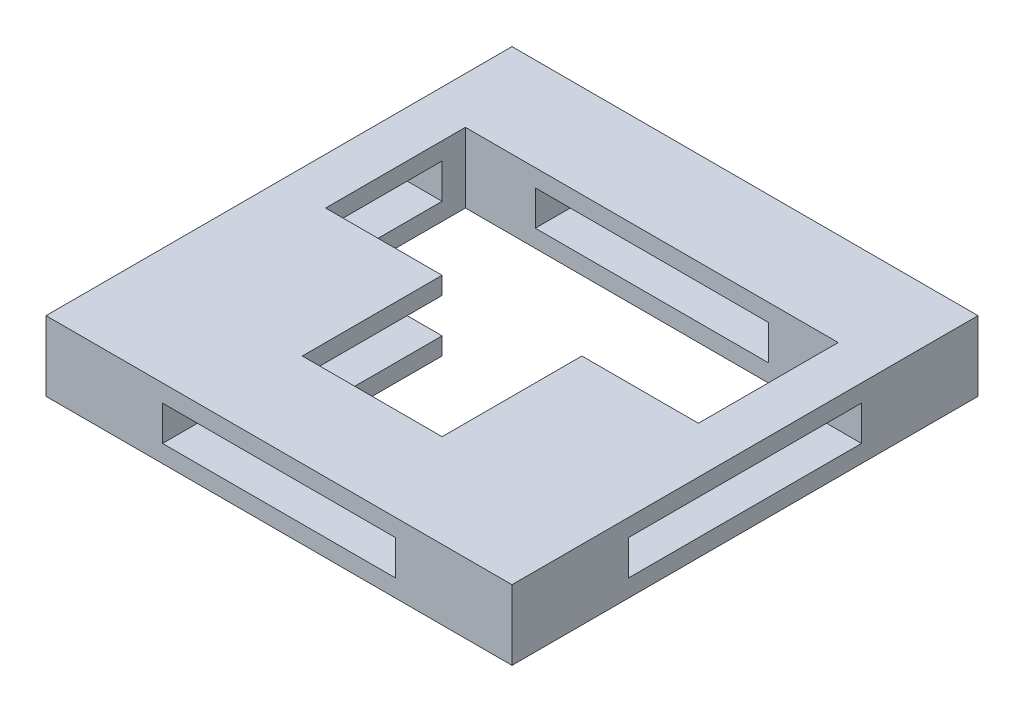
ISO-10303-21;
HEADER;
FILE_DESCRIPTION(('STEP AP214'),'2;1');
FILE_NAME('part.step','',(''),(''),'','','');
FILE_SCHEMA(('AUTOMOTIVE_DESIGN { 1 0 10303 214 1 1 1 1 }'));
ENDSEC;
DATA;
#1=APPLICATION_CONTEXT('core data for automotive mechanical design processes');
#2=APPLICATION_PROTOCOL_DEFINITION('international standard','automotive_design',2000,#1);
#3=PRODUCT_CONTEXT('',#1,'mechanical');
#4=PRODUCT('Part','Part','',(#3));
#5=PRODUCT_RELATED_PRODUCT_CATEGORY('part','',(#4));
#6=PRODUCT_DEFINITION_FORMATION('','',#4);
#7=PRODUCT_DEFINITION_CONTEXT('part definition',#1,'design');
#8=PRODUCT_DEFINITION('design','',#6,#7);
#9=PRODUCT_DEFINITION_SHAPE('','',#8);
#10=(LENGTH_UNIT() NAMED_UNIT(*) SI_UNIT(.MILLI.,.METRE.));
#11=(NAMED_UNIT(*) PLANE_ANGLE_UNIT() SI_UNIT($,.RADIAN.));
#12=(NAMED_UNIT(*) SI_UNIT($,.STERADIAN.) SOLID_ANGLE_UNIT());
#13=UNCERTAINTY_MEASURE_WITH_UNIT(LENGTH_MEASURE(1.E-05),#10,'distance_accuracy_value','');
#14=(GEOMETRIC_REPRESENTATION_CONTEXT(3) GLOBAL_UNCERTAINTY_ASSIGNED_CONTEXT((#13)) GLOBAL_UNIT_ASSIGNED_CONTEXT((#10,
#11,#12)) REPRESENTATION_CONTEXT('',''));
#15=CARTESIAN_POINT('',(0.,0.,0.));
#16=DIRECTION('',(0.,0.,1.));
#17=DIRECTION('',(1.,0.,0.));
#18=AXIS2_PLACEMENT_3D('',#15,#16,#17);
#19=CARTESIAN_POINT('',(0.,3.,0.));
#20=DIRECTION('',(0.,0.,-1.));
#21=DIRECTION('',(-1.,0.,0.));
#22=AXIS2_PLACEMENT_3D('',#19,#20,#21);
#23=PLANE('',#22);
#24=DIRECTION('',(1.,0.,0.));
#25=VECTOR('',#24,1.);
#26=CARTESIAN_POINT('',(0.,2.25,0.));
#27=LINE('',#26,#25);
#28=CARTESIAN_POINT('',(-8.,2.25,0.));
#29=VERTEX_POINT('',#28);
#30=CARTESIAN_POINT('',(-3.,2.25,0.));
#31=VERTEX_POINT('',#30);
#32=EDGE_CURVE('E421',#29,#31,#27,.T.);
#33=ORIENTED_EDGE('',*,*,#32,.F.);
#34=DIRECTION('',(0.,-1.,0.));
#35=VECTOR('',#34,1.);
#36=CARTESIAN_POINT('',(-8.,3.,0.));
#37=LINE('',#36,#35);
#38=CARTESIAN_POINT('',(-8.,3.,0.));
#39=VERTEX_POINT('',#38);
#40=EDGE_CURVE('E557',#39,#29,#37,.T.);
#41=ORIENTED_EDGE('',*,*,#40,.F.);
#42=DIRECTION('',(1.,0.,0.));
#43=VECTOR('',#42,1.);
#44=CARTESIAN_POINT('',(0.,3.,0.));
#45=LINE('',#44,#43);
#46=CARTESIAN_POINT('',(-3.,3.,0.));
#47=VERTEX_POINT('',#46);
#48=EDGE_CURVE('E437',#39,#47,#45,.T.);
#49=ORIENTED_EDGE('',*,*,#48,.T.);
#50=DIRECTION('',(0.,-1.,0.));
#51=VECTOR('',#50,1.);
#52=CARTESIAN_POINT('',(-3.,3.,0.));
#53=LINE('',#52,#51);
#54=EDGE_CURVE('E521',#47,#31,#53,.T.);
#55=ORIENTED_EDGE('',*,*,#54,.T.);
#56=EDGE_LOOP('',(#33,#41,#49,#55));
#57=FACE_BOUND('',#56,.T.);
#58=ADVANCED_FACE('F39',(#57),#23,.T.);
#59=DIRECTION('',(0.,-1.,0.));
#60=VECTOR('',#59,1.);
#61=CARTESIAN_POINT('',(8.,3.,0.));
#62=LINE('',#61,#60);
#63=CARTESIAN_POINT('',(8.,3.,0.));
#64=VERTEX_POINT('',#63);
#65=CARTESIAN_POINT('',(8.,2.25,0.));
#66=VERTEX_POINT('',#65);
#67=EDGE_CURVE('E545',#64,#66,#62,.T.);
#68=ORIENTED_EDGE('',*,*,#67,.T.);
#69=DIRECTION('',(1.,0.,0.));
#70=VECTOR('',#69,1.);
#71=CARTESIAN_POINT('',(0.,2.25,0.));
#72=LINE('',#71,#70);
#73=CARTESIAN_POINT('',(3.,2.25,0.));
#74=VERTEX_POINT('',#73);
#75=EDGE_CURVE('E415',#74,#66,#72,.T.);
#76=ORIENTED_EDGE('',*,*,#75,.F.);
#77=DIRECTION('',(0.,-1.,0.));
#78=VECTOR('',#77,1.);
#79=CARTESIAN_POINT('',(3.,3.,0.));
#80=LINE('',#79,#78);
#81=CARTESIAN_POINT('',(3.,3.,0.));
#82=VERTEX_POINT('',#81);
#83=EDGE_CURVE('E540',#82,#74,#80,.T.);
#84=ORIENTED_EDGE('',*,*,#83,.F.);
#85=EDGE_CURVE('E443',#82,#64,#45,.T.);
#86=ORIENTED_EDGE('',*,*,#85,.T.);
#87=EDGE_LOOP('',(#68,#76,#84,#86));
#88=FACE_BOUND('',#87,.T.);
#89=ADVANCED_FACE('F661',(#88),#23,.T.);
#90=CARTESIAN_POINT('',(-3.,3.,0.));
#91=DIRECTION('',(1.,0.,0.));
#92=DIRECTION('',(0.,0.,-1.));
#93=AXIS2_PLACEMENT_3D('',#90,#91,#92);
#94=PLANE('',#93);
#95=DIRECTION('',(0.,0.,1.));
#96=VECTOR('',#95,1.);
#97=CARTESIAN_POINT('',(-3.,2.25,0.));
#98=LINE('',#97,#96);
#99=CARTESIAN_POINT('',(-3.,2.25,6.));
#100=VERTEX_POINT('',#99);
#101=EDGE_CURVE('E418',#31,#100,#98,.T.);
#102=ORIENTED_EDGE('',*,*,#101,.F.);
#103=ORIENTED_EDGE('',*,*,#54,.F.);
#104=DIRECTION('',(0.,0.,1.));
#105=VECTOR('',#104,1.);
#106=CARTESIAN_POINT('',(-3.,3.,0.));
#107=LINE('',#106,#105);
#108=CARTESIAN_POINT('',(-3.,3.,6.));
#109=VERTEX_POINT('',#108);
#110=EDGE_CURVE('E433',#47,#109,#107,.T.);
#111=ORIENTED_EDGE('',*,*,#110,.T.);
#112=DIRECTION('',(0.,-1.,0.));
#113=VECTOR('',#112,1.);
#114=CARTESIAN_POINT('',(-3.,3.,6.));
#115=LINE('',#114,#113);
#116=EDGE_CURVE('E530',#109,#100,#115,.T.);
#117=ORIENTED_EDGE('',*,*,#116,.T.);
#118=EDGE_LOOP('',(#102,#103,#111,#117));
#119=FACE_BOUND('',#118,.T.);
#120=ADVANCED_FACE('F658',(#119),#94,.T.);
#121=CARTESIAN_POINT('',(3.,3.,0.));
#122=DIRECTION('',(1.,0.,0.));
#123=DIRECTION('',(0.,0.,-1.));
#124=AXIS2_PLACEMENT_3D('',#121,#122,#123);
#125=PLANE('',#124);
#126=ORIENTED_EDGE('',*,*,#83,.T.);
#127=DIRECTION('',(0.,0.,1.));
#128=VECTOR('',#127,1.);
#129=CARTESIAN_POINT('',(3.,2.25,0.));
#130=LINE('',#129,#128);
#131=CARTESIAN_POINT('',(3.,2.25,6.));
#132=VERTEX_POINT('',#131);
#133=EDGE_CURVE('E412',#74,#132,#130,.T.);
#134=ORIENTED_EDGE('',*,*,#133,.T.);
#135=DIRECTION('',(0.,-1.,0.));
#136=VECTOR('',#135,1.);
#137=CARTESIAN_POINT('',(3.,3.,6.));
#138=LINE('',#137,#136);
#139=CARTESIAN_POINT('',(3.,3.,6.));
#140=VERTEX_POINT('',#139);
#141=EDGE_CURVE('E535',#140,#132,#138,.T.);
#142=ORIENTED_EDGE('',*,*,#141,.F.);
#143=DIRECTION('',(0.,0.,1.));
#144=VECTOR('',#143,1.);
#145=CARTESIAN_POINT('',(3.,3.,0.));
#146=LINE('',#145,#144);
#147=EDGE_CURVE('E453',#82,#140,#146,.T.);
#148=ORIENTED_EDGE('',*,*,#147,.F.);
#149=EDGE_LOOP('',(#126,#134,#142,#148));
#150=FACE_BOUND('',#149,.T.);
#151=ADVANCED_FACE('F648',(#150),#125,.F.);
#152=CARTESIAN_POINT('',(0.,3.,6.));
#153=DIRECTION('',(0.,0.,1.));
#154=DIRECTION('',(1.,0.,0.));
#155=AXIS2_PLACEMENT_3D('',#152,#153,#154);
#156=PLANE('',#155);
#157=ORIENTED_EDGE('',*,*,#141,.T.);
#158=DIRECTION('',(-1.,0.,0.));
#159=VECTOR('',#158,1.);
#160=CARTESIAN_POINT('',(0.,2.25,6.));
#161=LINE('',#160,#159);
#162=EDGE_CURVE('E408',#132,#100,#161,.T.);
#163=ORIENTED_EDGE('',*,*,#162,.T.);
#164=ORIENTED_EDGE('',*,*,#116,.F.);
#165=DIRECTION('',(-1.,0.,0.));
#166=VECTOR('',#165,1.);
#167=CARTESIAN_POINT('',(0.,3.,6.));
#168=LINE('',#167,#166);
#169=EDGE_CURVE('E456',#140,#109,#168,.T.);
#170=ORIENTED_EDGE('',*,*,#169,.F.);
#171=EDGE_LOOP('',(#157,#163,#164,#170));
#172=FACE_BOUND('',#171,.T.);
#173=ADVANCED_FACE('F655',(#172),#156,.F.);
#174=CARTESIAN_POINT('',(-10.,3.,0.));
#175=DIRECTION('',(-1.,0.,0.));
#176=DIRECTION('',(0.,0.,1.));
#177=AXIS2_PLACEMENT_3D('',#174,#175,#176);
#178=PLANE('',#177);
#179=DIRECTION('',(0.,-1.,0.));
#180=VECTOR('',#179,1.);
#181=CARTESIAN_POINT('',(-10.,0.749999999999996,5.));
#182=LINE('',#181,#180);
#183=CARTESIAN_POINT('',(-10.,2.25,5.));
#184=VERTEX_POINT('',#183);
#185=CARTESIAN_POINT('',(-10.,0.749999999999996,5.));
#186=VERTEX_POINT('',#185);
#187=EDGE_CURVE('E253',#184,#186,#182,.T.);
#188=ORIENTED_EDGE('',*,*,#187,.T.);
#189=DIRECTION('',(0.,0.,-1.));
#190=VECTOR('',#189,1.);
#191=CARTESIAN_POINT('',(-10.,0.749999999999997,-5.));
#192=LINE('',#191,#190);
#193=CARTESIAN_POINT('',(-10.,0.749999999999997,-5.));
#194=VERTEX_POINT('',#193);
#195=EDGE_CURVE('E264',#186,#194,#192,.T.);
#196=ORIENTED_EDGE('',*,*,#195,.T.);
#197=DIRECTION('',(0.,1.,0.));
#198=VECTOR('',#197,1.);
#199=CARTESIAN_POINT('',(-10.,0.749999999999997,-5.));
#200=LINE('',#199,#198);
#201=CARTESIAN_POINT('',(-10.,2.25,-5.));
#202=VERTEX_POINT('',#201);
#203=EDGE_CURVE('E55',#194,#202,#200,.T.);
#204=ORIENTED_EDGE('',*,*,#203,.T.);
#205=DIRECTION('',(0.,0.,1.));
#206=VECTOR('',#205,1.);
#207=CARTESIAN_POINT('',(-10.,2.25,-5.));
#208=LINE('',#207,#206);
#209=EDGE_CURVE('E274',#202,#184,#208,.T.);
#210=ORIENTED_EDGE('',*,*,#209,.T.);
#211=EDGE_LOOP('',(#188,#196,#204,#210));
#212=FACE_BOUND('',#211,.T.);
#213=DIRECTION('',(0.,0.,-1.));
#214=VECTOR('',#213,1.);
#215=CARTESIAN_POINT('',(-10.,0.,0.));
#216=LINE('',#215,#214);
#217=CARTESIAN_POINT('',(-10.,0.,10.));
#218=VERTEX_POINT('',#217);
#219=CARTESIAN_POINT('',(-10.,0.,-10.));
#220=VERTEX_POINT('',#219);
#221=EDGE_CURVE('E502',#218,#220,#216,.T.);
#222=ORIENTED_EDGE('',*,*,#221,.F.);
#223=DIRECTION('',(0.,-1.,0.));
#224=VECTOR('',#223,1.);
#225=CARTESIAN_POINT('',(-10.,3.,10.));
#226=LINE('',#225,#224);
#227=CARTESIAN_POINT('',(-10.,3.,10.));
#228=VERTEX_POINT('',#227);
#229=EDGE_CURVE('E48',#228,#218,#226,.T.);
#230=ORIENTED_EDGE('',*,*,#229,.F.);
#231=DIRECTION('',(0.,0.,-1.));
#232=VECTOR('',#231,1.);
#233=CARTESIAN_POINT('',(-10.,3.,0.));
#234=LINE('',#233,#232);
#235=CARTESIAN_POINT('',(-10.,3.,-10.));
#236=VERTEX_POINT('',#235);
#237=EDGE_CURVE('E459',#228,#236,#234,.T.);
#238=ORIENTED_EDGE('',*,*,#237,.T.);
#239=DIRECTION('',(0.,-1.,0.));
#240=VECTOR('',#239,1.);
#241=CARTESIAN_POINT('',(-10.,3.,-10.));
#242=LINE('',#241,#240);
#243=EDGE_CURVE('E517',#236,#220,#242,.T.);
#244=ORIENTED_EDGE('',*,*,#243,.T.);
#245=EDGE_LOOP('',(#222,#230,#238,#244));
#246=FACE_BOUND('',#245,.T.);
#247=ADVANCED_FACE('F271',(#212,#246),#178,.T.);
#248=CARTESIAN_POINT('',(0.,3.,10.));
#249=DIRECTION('',(0.,0.,1.));
#250=DIRECTION('',(1.,0.,0.));
#251=AXIS2_PLACEMENT_3D('',#248,#249,#250);
#252=PLANE('',#251);
#253=DIRECTION('',(0.,-1.,0.));
#254=VECTOR('',#253,1.);
#255=CARTESIAN_POINT('',(-5.,0.75,10.));
#256=LINE('',#255,#254);
#257=CARTESIAN_POINT('',(-5.,2.25,10.));
#258=VERTEX_POINT('',#257);
#259=CARTESIAN_POINT('',(-5.,0.75,10.));
#260=VERTEX_POINT('',#259);
#261=EDGE_CURVE('E332',#258,#260,#256,.T.);
#262=ORIENTED_EDGE('',*,*,#261,.F.);
#263=DIRECTION('',(-1.,0.,0.));
#264=VECTOR('',#263,1.);
#265=CARTESIAN_POINT('',(5.,2.25,10.));
#266=LINE('',#265,#264);
#267=CARTESIAN_POINT('',(5.,2.25,10.));
#268=VERTEX_POINT('',#267);
#269=EDGE_CURVE('E338',#268,#258,#266,.T.);
#270=ORIENTED_EDGE('',*,*,#269,.F.);
#271=DIRECTION('',(0.,1.,0.));
#272=VECTOR('',#271,1.);
#273=CARTESIAN_POINT('',(5.,0.750000000000001,10.));
#274=LINE('',#273,#272);
#275=CARTESIAN_POINT('',(5.,0.750000000000001,10.));
#276=VERTEX_POINT('',#275);
#277=EDGE_CURVE('E358',#276,#268,#274,.T.);
#278=ORIENTED_EDGE('',*,*,#277,.F.);
#279=DIRECTION('',(1.,0.,0.));
#280=VECTOR('',#279,1.);
#281=CARTESIAN_POINT('',(5.,0.750000000000001,10.));
#282=LINE('',#281,#280);
#283=EDGE_CURVE('E354',#260,#276,#282,.T.);
#284=ORIENTED_EDGE('',*,*,#283,.F.);
#285=EDGE_LOOP('',(#262,#270,#278,#284));
#286=FACE_BOUND('',#285,.T.);
#287=DIRECTION('',(-1.,0.,0.));
#288=VECTOR('',#287,1.);
#289=CARTESIAN_POINT('',(0.,0.,10.));
#290=LINE('',#289,#288);
#291=CARTESIAN_POINT('',(10.,0.,10.));
#292=VERTEX_POINT('',#291);
#293=EDGE_CURVE('E506',#292,#218,#290,.T.);
#294=ORIENTED_EDGE('',*,*,#293,.F.);
#295=DIRECTION('',(0.,-1.,0.));
#296=VECTOR('',#295,1.);
#297=CARTESIAN_POINT('',(10.,3.,10.));
#298=LINE('',#297,#296);
#299=CARTESIAN_POINT('',(10.,3.,10.));
#300=VERTEX_POINT('',#299);
#301=EDGE_CURVE('E525',#300,#292,#298,.T.);
#302=ORIENTED_EDGE('',*,*,#301,.F.);
#303=DIRECTION('',(-1.,0.,0.));
#304=VECTOR('',#303,1.);
#305=CARTESIAN_POINT('',(0.,3.,10.));
#306=LINE('',#305,#304);
#307=EDGE_CURVE('E463',#300,#228,#306,.T.);
#308=ORIENTED_EDGE('',*,*,#307,.T.);
#309=ORIENTED_EDGE('',*,*,#229,.T.);
#310=EDGE_LOOP('',(#294,#302,#308,#309));
#311=FACE_BOUND('',#310,.T.);
#312=ADVANCED_FACE('F681',(#286,#311),#252,.T.);
#313=CARTESIAN_POINT('',(10.,3.,0.));
#314=DIRECTION('',(-1.,0.,0.));
#315=DIRECTION('',(0.,0.,1.));
#316=AXIS2_PLACEMENT_3D('',#313,#314,#315);
#317=PLANE('',#316);
#318=DIRECTION('',(0.,0.,-1.));
#319=VECTOR('',#318,1.);
#320=CARTESIAN_POINT('',(10.,0.749999999999997,-5.));
#321=LINE('',#320,#319);
#322=CARTESIAN_POINT('',(10.,0.749999999999996,5.));
#323=VERTEX_POINT('',#322);
#324=CARTESIAN_POINT('',(10.,0.749999999999997,-5.));
#325=VERTEX_POINT('',#324);
#326=EDGE_CURVE('E289',#323,#325,#321,.T.);
#327=ORIENTED_EDGE('',*,*,#326,.F.);
#328=DIRECTION('',(0.,-1.,0.));
#329=VECTOR('',#328,1.);
#330=CARTESIAN_POINT('',(10.,0.749999999999996,5.));
#331=LINE('',#330,#329);
#332=CARTESIAN_POINT('',(10.,2.25,5.));
#333=VERTEX_POINT('',#332);
#334=EDGE_CURVE('E63',#333,#323,#331,.T.);
#335=ORIENTED_EDGE('',*,*,#334,.F.);
#336=DIRECTION('',(0.,0.,1.));
#337=VECTOR('',#336,1.);
#338=CARTESIAN_POINT('',(10.,2.25,-5.));
#339=LINE('',#338,#337);
#340=CARTESIAN_POINT('',(10.,2.25,-5.));
#341=VERTEX_POINT('',#340);
#342=EDGE_CURVE('E276',#341,#333,#339,.T.);
#343=ORIENTED_EDGE('',*,*,#342,.F.);
#344=DIRECTION('',(0.,1.,0.));
#345=VECTOR('',#344,1.);
#346=CARTESIAN_POINT('',(10.,0.749999999999997,-5.));
#347=LINE('',#346,#345);
#348=EDGE_CURVE('E280',#325,#341,#347,.T.);
#349=ORIENTED_EDGE('',*,*,#348,.F.);
#350=EDGE_LOOP('',(#327,#335,#343,#349));
#351=FACE_BOUND('',#350,.T.);
#352=DIRECTION('',(0.,0.,-1.));
#353=VECTOR('',#352,1.);
#354=CARTESIAN_POINT('',(10.,0.,0.));
#355=LINE('',#354,#353);
#356=CARTESIAN_POINT('',(10.,0.,-10.));
#357=VERTEX_POINT('',#356);
#358=EDGE_CURVE('E510',#292,#357,#355,.T.);
#359=ORIENTED_EDGE('',*,*,#358,.T.);
#360=DIRECTION('',(0.,-1.,0.));
#361=VECTOR('',#360,1.);
#362=CARTESIAN_POINT('',(10.,3.,-10.));
#363=LINE('',#362,#361);
#364=CARTESIAN_POINT('',(10.,3.,-10.));
#365=VERTEX_POINT('',#364);
#366=EDGE_CURVE('E520',#365,#357,#363,.T.);
#367=ORIENTED_EDGE('',*,*,#366,.F.);
#368=DIRECTION('',(0.,0.,-1.));
#369=VECTOR('',#368,1.);
#370=CARTESIAN_POINT('',(10.,3.,0.));
#371=LINE('',#370,#369);
#372=EDGE_CURVE('E467',#300,#365,#371,.T.);
#373=ORIENTED_EDGE('',*,*,#372,.F.);
#374=ORIENTED_EDGE('',*,*,#301,.T.);
#375=EDGE_LOOP('',(#359,#367,#373,#374));
#376=FACE_BOUND('',#375,.T.);
#377=ADVANCED_FACE('F623',(#351,#376),#317,.F.);
#378=DIRECTION('',(0.,0.,-1.));
#379=VECTOR('',#378,1.);
#380=CARTESIAN_POINT('',(-3.,0.750000000000001,0.));
#381=LINE('',#380,#379);
#382=CARTESIAN_POINT('',(-3.,0.750000000000001,6.));
#383=VERTEX_POINT('',#382);
#384=CARTESIAN_POINT('',(-3.,0.750000000000001,0.));
#385=VERTEX_POINT('',#384);
#386=EDGE_CURVE('E394',#383,#385,#381,.T.);
#387=ORIENTED_EDGE('',*,*,#386,.F.);
#388=CARTESIAN_POINT('',(-3.,0.,6.));
#389=VERTEX_POINT('',#388);
#390=EDGE_CURVE('E474',#383,#389,#115,.T.);
#391=ORIENTED_EDGE('',*,*,#390,.T.);
#392=DIRECTION('',(0.,0.,1.));
#393=VECTOR('',#392,1.);
#394=CARTESIAN_POINT('',(-3.,0.,0.));
#395=LINE('',#394,#393);
#396=CARTESIAN_POINT('',(-3.,0.,0.));
#397=VERTEX_POINT('',#396);
#398=EDGE_CURVE('E432',#397,#389,#395,.T.);
#399=ORIENTED_EDGE('',*,*,#398,.F.);
#400=EDGE_CURVE('E560',#385,#397,#53,.T.);
#401=ORIENTED_EDGE('',*,*,#400,.F.);
#402=EDGE_LOOP('',(#387,#391,#399,#401));
#403=FACE_BOUND('',#402,.T.);
#404=ADVANCED_FACE('F41',(#403),#94,.T.);
#405=CARTESIAN_POINT('',(-8.,0.749999999999997,0.));
#406=VERTEX_POINT('',#405);
#407=CARTESIAN_POINT('',(-8.,0.,0.));
#408=VERTEX_POINT('',#407);
#409=EDGE_CURVE('E556',#406,#408,#37,.T.);
#410=ORIENTED_EDGE('',*,*,#409,.F.);
#411=DIRECTION('',(-1.,0.,0.));
#412=VECTOR('',#411,1.);
#413=CARTESIAN_POINT('',(0.,0.750000000000001,0.));
#414=LINE('',#413,#412);
#415=EDGE_CURVE('E397',#385,#406,#414,.T.);
#416=ORIENTED_EDGE('',*,*,#415,.F.);
#417=ORIENTED_EDGE('',*,*,#400,.T.);
#418=DIRECTION('',(1.,0.,0.));
#419=VECTOR('',#418,1.);
#420=CARTESIAN_POINT('',(0.,0.,0.));
#421=LINE('',#420,#419);
#422=EDGE_CURVE('E478',#408,#397,#421,.T.);
#423=ORIENTED_EDGE('',*,*,#422,.F.);
#424=EDGE_LOOP('',(#410,#416,#417,#423));
#425=FACE_BOUND('',#424,.T.);
#426=ADVANCED_FACE('F571',(#425),#23,.T.);
#427=CARTESIAN_POINT('',(-8.,3.,0.));
#428=DIRECTION('',(-1.,0.,0.));
#429=DIRECTION('',(0.,0.,1.));
#430=AXIS2_PLACEMENT_3D('',#427,#428,#429);
#431=PLANE('',#430);
#432=ORIENTED_EDGE('',*,*,#40,.T.);
#433=DIRECTION('',(0.,0.,-1.));
#434=VECTOR('',#433,1.);
#435=CARTESIAN_POINT('',(-8.,2.25,0.));
#436=LINE('',#435,#434);
#437=CARTESIAN_POINT('',(-8.,2.25,-5.));
#438=VERTEX_POINT('',#437);
#439=EDGE_CURVE('E324',#29,#438,#436,.T.);
#440=ORIENTED_EDGE('',*,*,#439,.T.);
#441=DIRECTION('',(0.,-1.,0.));
#442=VECTOR('',#441,1.);
#443=CARTESIAN_POINT('',(-8.,3.,-5.));
#444=LINE('',#443,#442);
#445=CARTESIAN_POINT('',(-8.,0.749999999999997,-5.));
#446=VERTEX_POINT('',#445);
#447=EDGE_CURVE('E328',#438,#446,#444,.T.);
#448=ORIENTED_EDGE('',*,*,#447,.T.);
#449=DIRECTION('',(0.,0.,1.));
#450=VECTOR('',#449,1.);
#451=CARTESIAN_POINT('',(-8.,0.749999999999997,0.));
#452=LINE('',#451,#450);
#453=EDGE_CURVE('E313',#446,#406,#452,.T.);
#454=ORIENTED_EDGE('',*,*,#453,.T.);
#455=ORIENTED_EDGE('',*,*,#409,.T.);
#456=DIRECTION('',(0.,0.,-1.));
#457=VECTOR('',#456,1.);
#458=CARTESIAN_POINT('',(-8.,0.,0.));
#459=LINE('',#458,#457);
#460=CARTESIAN_POINT('',(-8.,0.,-6.));
#461=VERTEX_POINT('',#460);
#462=EDGE_CURVE('E482',#408,#461,#459,.T.);
#463=ORIENTED_EDGE('',*,*,#462,.T.);
#464=DIRECTION('',(0.,-1.,0.));
#465=VECTOR('',#464,1.);
#466=CARTESIAN_POINT('',(-8.,3.,-6.));
#467=LINE('',#466,#465);
#468=CARTESIAN_POINT('',(-8.,3.,-6.));
#469=VERTEX_POINT('',#468);
#470=EDGE_CURVE('E552',#469,#461,#467,.T.);
#471=ORIENTED_EDGE('',*,*,#470,.F.);
#472=DIRECTION('',(0.,0.,-1.));
#473=VECTOR('',#472,1.);
#474=CARTESIAN_POINT('',(-8.,3.,0.));
#475=LINE('',#474,#473);
#476=EDGE_CURVE('E442',#39,#469,#475,.T.);
#477=ORIENTED_EDGE('',*,*,#476,.F.);
#478=EDGE_LOOP('',(#432,#440,#448,#454,#455,#463,#471,#477));
#479=FACE_BOUND('',#478,.T.);
#480=ADVANCED_FACE('F583',(#479),#431,.F.);
#481=CARTESIAN_POINT('',(0.,3.,-6.));
#482=DIRECTION('',(0.,0.,-1.));
#483=DIRECTION('',(-1.,0.,0.));
#484=AXIS2_PLACEMENT_3D('',#481,#482,#483);
#485=PLANE('',#484);
#486=DIRECTION('',(-1.,0.,0.));
#487=VECTOR('',#486,1.);
#488=CARTESIAN_POINT('',(0.,0.750000000000001,-6.));
#489=LINE('',#488,#487);
#490=CARTESIAN_POINT('',(5.,0.750000000000001,-6.));
#491=VERTEX_POINT('',#490);
#492=CARTESIAN_POINT('',(-5.,0.75,-6.));
#493=VERTEX_POINT('',#492);
#494=EDGE_CURVE('E400',#491,#493,#489,.T.);
#495=ORIENTED_EDGE('',*,*,#494,.T.);
#496=DIRECTION('',(0.,1.,0.));
#497=VECTOR('',#496,1.);
#498=CARTESIAN_POINT('',(-5.,3.,-6.));
#499=LINE('',#498,#497);
#500=CARTESIAN_POINT('',(-5.,2.25,-6.));
#501=VERTEX_POINT('',#500);
#502=EDGE_CURVE('E428',#493,#501,#499,.T.);
#503=ORIENTED_EDGE('',*,*,#502,.T.);
#504=DIRECTION('',(1.,0.,0.));
#505=VECTOR('',#504,1.);
#506=CARTESIAN_POINT('',(0.,2.25,-6.));
#507=LINE('',#506,#505);
#508=CARTESIAN_POINT('',(5.,2.25,-6.));
#509=VERTEX_POINT('',#508);
#510=EDGE_CURVE('E424',#501,#509,#507,.T.);
#511=ORIENTED_EDGE('',*,*,#510,.T.);
#512=DIRECTION('',(0.,-1.,0.));
#513=VECTOR('',#512,1.);
#514=CARTESIAN_POINT('',(5.,3.,-6.));
#515=LINE('',#514,#513);
#516=EDGE_CURVE('E404',#509,#491,#515,.T.);
#517=ORIENTED_EDGE('',*,*,#516,.T.);
#518=EDGE_LOOP('',(#495,#503,#511,#517));
#519=FACE_BOUND('',#518,.T.);
#520=DIRECTION('',(1.,0.,0.));
#521=VECTOR('',#520,1.);
#522=CARTESIAN_POINT('',(0.,0.,-6.));
#523=LINE('',#522,#521);
#524=CARTESIAN_POINT('',(8.,0.,-6.));
#525=VERTEX_POINT('',#524);
#526=EDGE_CURVE('E486',#461,#525,#523,.T.);
#527=ORIENTED_EDGE('',*,*,#526,.T.);
#528=DIRECTION('',(0.,-1.,0.));
#529=VECTOR('',#528,1.);
#530=CARTESIAN_POINT('',(8.,3.,-6.));
#531=LINE('',#530,#529);
#532=CARTESIAN_POINT('',(8.,3.,-6.));
#533=VERTEX_POINT('',#532);
#534=EDGE_CURVE('E549',#533,#525,#531,.T.);
#535=ORIENTED_EDGE('',*,*,#534,.F.);
#536=DIRECTION('',(1.,0.,0.));
#537=VECTOR('',#536,1.);
#538=CARTESIAN_POINT('',(0.,3.,-6.));
#539=LINE('',#538,#537);
#540=EDGE_CURVE('E446',#469,#533,#539,.T.);
#541=ORIENTED_EDGE('',*,*,#540,.F.);
#542=ORIENTED_EDGE('',*,*,#470,.T.);
#543=EDGE_LOOP('',(#527,#535,#541,#542));
#544=FACE_BOUND('',#543,.T.);
#545=ADVANCED_FACE('F587',(#519,#544),#485,.F.);
#546=CARTESIAN_POINT('',(8.,3.,0.));
#547=DIRECTION('',(-1.,0.,0.));
#548=DIRECTION('',(0.,0.,1.));
#549=AXIS2_PLACEMENT_3D('',#546,#547,#548);
#550=PLANE('',#549);
#551=DIRECTION('',(0.,0.,-1.));
#552=VECTOR('',#551,1.);
#553=CARTESIAN_POINT('',(8.,2.25,0.));
#554=LINE('',#553,#552);
#555=CARTESIAN_POINT('',(8.,2.25,-5.));
#556=VERTEX_POINT('',#555);
#557=EDGE_CURVE('E321',#66,#556,#554,.T.);
#558=ORIENTED_EDGE('',*,*,#557,.F.);
#559=ORIENTED_EDGE('',*,*,#67,.F.);
#560=DIRECTION('',(0.,0.,-1.));
#561=VECTOR('',#560,1.);
#562=CARTESIAN_POINT('',(8.,3.,0.));
#563=LINE('',#562,#561);
#564=EDGE_CURVE('E449',#64,#533,#563,.T.);
#565=ORIENTED_EDGE('',*,*,#564,.T.);
#566=ORIENTED_EDGE('',*,*,#534,.T.);
#567=DIRECTION('',(0.,0.,-1.));
#568=VECTOR('',#567,1.);
#569=CARTESIAN_POINT('',(8.,0.,0.));
#570=LINE('',#569,#568);
#571=CARTESIAN_POINT('',(8.,0.,0.));
#572=VERTEX_POINT('',#571);
#573=EDGE_CURVE('E490',#572,#525,#570,.T.);
#574=ORIENTED_EDGE('',*,*,#573,.F.);
#575=CARTESIAN_POINT('',(8.,0.749999999999997,0.));
#576=VERTEX_POINT('',#575);
#577=EDGE_CURVE('E544',#576,#572,#62,.T.);
#578=ORIENTED_EDGE('',*,*,#577,.F.);
#579=DIRECTION('',(0.,0.,1.));
#580=VECTOR('',#579,1.);
#581=CARTESIAN_POINT('',(8.,0.749999999999997,0.));
#582=LINE('',#581,#580);
#583=CARTESIAN_POINT('',(8.,0.749999999999997,-5.));
#584=VERTEX_POINT('',#583);
#585=EDGE_CURVE('E317',#584,#576,#582,.T.);
#586=ORIENTED_EDGE('',*,*,#585,.F.);
#587=DIRECTION('',(0.,-1.,0.));
#588=VECTOR('',#587,1.);
#589=CARTESIAN_POINT('',(8.,3.,-5.));
#590=LINE('',#589,#588);
#591=EDGE_CURVE('E11',#556,#584,#590,.T.);
#592=ORIENTED_EDGE('',*,*,#591,.F.);
#593=EDGE_LOOP('',(#558,#559,#565,#566,#574,#578,#586,#592));
#594=FACE_BOUND('',#593,.T.);
#595=ADVANCED_FACE('F634',(#594),#550,.T.);
#596=DIRECTION('',(-1.,0.,0.));
#597=VECTOR('',#596,1.);
#598=CARTESIAN_POINT('',(0.,0.750000000000001,0.));
#599=LINE('',#598,#597);
#600=CARTESIAN_POINT('',(3.,0.750000000000001,0.));
#601=VERTEX_POINT('',#600);
#602=EDGE_CURVE('E390',#576,#601,#599,.T.);
#603=ORIENTED_EDGE('',*,*,#602,.F.);
#604=ORIENTED_EDGE('',*,*,#577,.T.);
#605=CARTESIAN_POINT('',(3.,0.,0.));
#606=VERTEX_POINT('',#605);
#607=EDGE_CURVE('E483',#606,#572,#421,.T.);
#608=ORIENTED_EDGE('',*,*,#607,.F.);
#609=EDGE_CURVE('E539',#601,#606,#80,.T.);
#610=ORIENTED_EDGE('',*,*,#609,.F.);
#611=EDGE_LOOP('',(#603,#604,#608,#610));
#612=FACE_BOUND('',#611,.T.);
#613=ADVANCED_FACE('F638',(#612),#23,.T.);
#614=CARTESIAN_POINT('',(3.,0.750000000000001,6.));
#615=VERTEX_POINT('',#614);
#616=CARTESIAN_POINT('',(3.,0.,6.));
#617=VERTEX_POINT('',#616);
#618=EDGE_CURVE('E534',#615,#617,#138,.T.);
#619=ORIENTED_EDGE('',*,*,#618,.F.);
#620=DIRECTION('',(0.,0.,-1.));
#621=VECTOR('',#620,1.);
#622=CARTESIAN_POINT('',(3.,0.750000000000001,0.));
#623=LINE('',#622,#621);
#624=EDGE_CURVE('E387',#615,#601,#623,.T.);
#625=ORIENTED_EDGE('',*,*,#624,.T.);
#626=ORIENTED_EDGE('',*,*,#609,.T.);
#627=DIRECTION('',(0.,0.,1.));
#628=VECTOR('',#627,1.);
#629=CARTESIAN_POINT('',(3.,0.,0.));
#630=LINE('',#629,#628);
#631=EDGE_CURVE('E494',#606,#617,#630,.T.);
#632=ORIENTED_EDGE('',*,*,#631,.T.);
#633=EDGE_LOOP('',(#619,#625,#626,#632));
#634=FACE_BOUND('',#633,.T.);
#635=ADVANCED_FACE('F644',(#634),#125,.F.);
#636=ORIENTED_EDGE('',*,*,#390,.F.);
#637=DIRECTION('',(1.,0.,0.));
#638=VECTOR('',#637,1.);
#639=CARTESIAN_POINT('',(0.,0.750000000000001,6.));
#640=LINE('',#639,#638);
#641=EDGE_CURVE('E369',#383,#615,#640,.T.);
#642=ORIENTED_EDGE('',*,*,#641,.T.);
#643=ORIENTED_EDGE('',*,*,#618,.T.);
#644=DIRECTION('',(-1.,0.,0.));
#645=VECTOR('',#644,1.);
#646=CARTESIAN_POINT('',(0.,0.,6.));
#647=LINE('',#646,#645);
#648=EDGE_CURVE('E498',#617,#389,#647,.T.);
#649=ORIENTED_EDGE('',*,*,#648,.T.);
#650=EDGE_LOOP('',(#636,#642,#643,#649));
#651=FACE_BOUND('',#650,.T.);
#652=ADVANCED_FACE('F643',(#651),#156,.F.);
#653=CARTESIAN_POINT('',(0.,3.,-10.));
#654=DIRECTION('',(0.,0.,1.));
#655=DIRECTION('',(1.,0.,0.));
#656=AXIS2_PLACEMENT_3D('',#653,#654,#655);
#657=PLANE('',#656);
#658=DIRECTION('',(-1.,0.,0.));
#659=VECTOR('',#658,1.);
#660=CARTESIAN_POINT('',(5.,2.25,-10.));
#661=LINE('',#660,#659);
#662=CARTESIAN_POINT('',(5.,2.25,-10.));
#663=VERTEX_POINT('',#662);
#664=CARTESIAN_POINT('',(-5.,2.25,-10.));
#665=VERTEX_POINT('',#664);
#666=EDGE_CURVE('E346',#663,#665,#661,.T.);
#667=ORIENTED_EDGE('',*,*,#666,.T.);
#668=DIRECTION('',(0.,-1.,0.));
#669=VECTOR('',#668,1.);
#670=CARTESIAN_POINT('',(-5.,0.75,-10.));
#671=LINE('',#670,#669);
#672=CARTESIAN_POINT('',(-5.,0.75,-10.));
#673=VERTEX_POINT('',#672);
#674=EDGE_CURVE('E333',#665,#673,#671,.T.);
#675=ORIENTED_EDGE('',*,*,#674,.T.);
#676=DIRECTION('',(1.,0.,0.));
#677=VECTOR('',#676,1.);
#678=CARTESIAN_POINT('',(5.,0.750000000000001,-10.));
#679=LINE('',#678,#677);
#680=CARTESIAN_POINT('',(5.,0.750000000000001,-10.));
#681=VERTEX_POINT('',#680);
#682=EDGE_CURVE('E337',#673,#681,#679,.T.);
#683=ORIENTED_EDGE('',*,*,#682,.T.);
#684=DIRECTION('',(0.,1.,0.));
#685=VECTOR('',#684,1.);
#686=CARTESIAN_POINT('',(5.,0.750000000000001,-10.));
#687=LINE('',#686,#685);
#688=EDGE_CURVE('E342',#681,#663,#687,.T.);
#689=ORIENTED_EDGE('',*,*,#688,.T.);
#690=EDGE_LOOP('',(#667,#675,#683,#689));
#691=FACE_BOUND('',#690,.T.);
#692=DIRECTION('',(-1.,0.,0.));
#693=VECTOR('',#692,1.);
#694=CARTESIAN_POINT('',(0.,0.,-10.));
#695=LINE('',#694,#693);
#696=EDGE_CURVE('E438',#357,#220,#695,.T.);
#697=ORIENTED_EDGE('',*,*,#696,.T.);
#698=ORIENTED_EDGE('',*,*,#243,.F.);
#699=DIRECTION('',(-1.,0.,0.));
#700=VECTOR('',#699,1.);
#701=CARTESIAN_POINT('',(0.,3.,-10.));
#702=LINE('',#701,#700);
#703=EDGE_CURVE('E471',#365,#236,#702,.T.);
#704=ORIENTED_EDGE('',*,*,#703,.F.);
#705=ORIENTED_EDGE('',*,*,#366,.T.);
#706=EDGE_LOOP('',(#697,#698,#704,#705));
#707=FACE_BOUND('',#706,.T.);
#708=ADVANCED_FACE('F653',(#691,#707),#657,.F.);
#709=CARTESIAN_POINT('',(0.,3.,0.));
#710=DIRECTION('',(0.,1.,0.));
#711=DIRECTION('',(0.,0.,1.));
#712=AXIS2_PLACEMENT_3D('',#709,#710,#711);
#713=PLANE('',#712);
#714=ORIENTED_EDGE('',*,*,#110,.F.);
#715=ORIENTED_EDGE('',*,*,#48,.F.);
#716=ORIENTED_EDGE('',*,*,#476,.T.);
#717=ORIENTED_EDGE('',*,*,#540,.T.);
#718=ORIENTED_EDGE('',*,*,#564,.F.);
#719=ORIENTED_EDGE('',*,*,#85,.F.);
#720=ORIENTED_EDGE('',*,*,#147,.T.);
#721=ORIENTED_EDGE('',*,*,#169,.T.);
#722=EDGE_LOOP('',(#714,#715,#716,#717,#718,#719,#720,#721));
#723=FACE_BOUND('',#722,.T.);
#724=ORIENTED_EDGE('',*,*,#237,.F.);
#725=ORIENTED_EDGE('',*,*,#307,.F.);
#726=ORIENTED_EDGE('',*,*,#372,.T.);
#727=ORIENTED_EDGE('',*,*,#703,.T.);
#728=EDGE_LOOP('',(#724,#725,#726,#727));
#729=FACE_BOUND('',#728,.T.);
#730=ADVANCED_FACE('F592',(#723,#729),#713,.T.);
#731=CARTESIAN_POINT('',(0.,0.,0.));
#732=DIRECTION('',(0.,1.,0.));
#733=DIRECTION('',(0.,0.,1.));
#734=AXIS2_PLACEMENT_3D('',#731,#732,#733);
#735=PLANE('',#734);
#736=ORIENTED_EDGE('',*,*,#398,.T.);
#737=ORIENTED_EDGE('',*,*,#648,.F.);
#738=ORIENTED_EDGE('',*,*,#631,.F.);
#739=ORIENTED_EDGE('',*,*,#607,.T.);
#740=ORIENTED_EDGE('',*,*,#573,.T.);
#741=ORIENTED_EDGE('',*,*,#526,.F.);
#742=ORIENTED_EDGE('',*,*,#462,.F.);
#743=ORIENTED_EDGE('',*,*,#422,.T.);
#744=EDGE_LOOP('',(#736,#737,#738,#739,#740,#741,#742,#743));
#745=FACE_BOUND('',#744,.T.);
#746=ORIENTED_EDGE('',*,*,#221,.T.);
#747=ORIENTED_EDGE('',*,*,#696,.F.);
#748=ORIENTED_EDGE('',*,*,#358,.F.);
#749=ORIENTED_EDGE('',*,*,#293,.T.);
#750=EDGE_LOOP('',(#746,#747,#748,#749));
#751=FACE_BOUND('',#750,.T.);
#752=ADVANCED_FACE('F578',(#745,#751),#735,.F.);
#753=CARTESIAN_POINT('',(5.,0.750000000000001,-10.));
#754=DIRECTION('',(0.,-1.,0.));
#755=DIRECTION('',(1.,0.,0.));
#756=AXIS2_PLACEMENT_3D('',#753,#754,#755);
#757=PLANE('',#756);
#758=DIRECTION('',(0.,0.,1.));
#759=VECTOR('',#758,1.);
#760=CARTESIAN_POINT('',(5.,0.750000000000001,-10.));
#761=LINE('',#760,#759);
#762=EDGE_CURVE('E376',#681,#491,#761,.T.);
#763=ORIENTED_EDGE('',*,*,#762,.F.);
#764=ORIENTED_EDGE('',*,*,#682,.F.);
#765=DIRECTION('',(0.,0.,1.));
#766=VECTOR('',#765,1.);
#767=CARTESIAN_POINT('',(-5.,0.75,-10.));
#768=LINE('',#767,#766);
#769=EDGE_CURVE('E381',#673,#493,#768,.T.);
#770=ORIENTED_EDGE('',*,*,#769,.T.);
#771=ORIENTED_EDGE('',*,*,#494,.F.);
#772=EDGE_LOOP('',(#763,#764,#770,#771));
#773=FACE_BOUND('',#772,.T.);
#774=ADVANCED_FACE('F723',(#773),#757,.F.);
#775=CARTESIAN_POINT('',(5.,0.750000000000001,-10.));
#776=DIRECTION('',(1.,0.,0.));
#777=DIRECTION('',(0.,0.,-1.));
#778=AXIS2_PLACEMENT_3D('',#775,#776,#777);
#779=PLANE('',#778);
#780=DIRECTION('',(0.,0.,1.));
#781=VECTOR('',#780,1.);
#782=CARTESIAN_POINT('',(5.,2.25,-10.));
#783=LINE('',#782,#781);
#784=EDGE_CURVE('E371',#663,#509,#783,.T.);
#785=ORIENTED_EDGE('',*,*,#784,.F.);
#786=ORIENTED_EDGE('',*,*,#688,.F.);
#787=ORIENTED_EDGE('',*,*,#762,.T.);
#788=ORIENTED_EDGE('',*,*,#516,.F.);
#789=EDGE_LOOP('',(#785,#786,#787,#788));
#790=FACE_BOUND('',#789,.T.);
#791=ADVANCED_FACE('F808',(#790),#779,.F.);
#792=CARTESIAN_POINT('',(5.,2.25,-10.));
#793=DIRECTION('',(0.,1.,0.));
#794=DIRECTION('',(0.,0.,1.));
#795=AXIS2_PLACEMENT_3D('',#792,#793,#794);
#796=PLANE('',#795);
#797=DIRECTION('',(0.,0.,1.));
#798=VECTOR('',#797,1.);
#799=CARTESIAN_POINT('',(-5.,2.25,-10.));
#800=LINE('',#799,#798);
#801=EDGE_CURVE('E365',#665,#501,#800,.T.);
#802=ORIENTED_EDGE('',*,*,#801,.F.);
#803=ORIENTED_EDGE('',*,*,#666,.F.);
#804=ORIENTED_EDGE('',*,*,#784,.T.);
#805=ORIENTED_EDGE('',*,*,#510,.F.);
#806=EDGE_LOOP('',(#802,#803,#804,#805));
#807=FACE_BOUND('',#806,.T.);
#808=ADVANCED_FACE('F714',(#807),#796,.F.);
#809=CARTESIAN_POINT('',(-5.,0.75,-10.));
#810=DIRECTION('',(-1.,0.,0.));
#811=DIRECTION('',(0.,0.,1.));
#812=AXIS2_PLACEMENT_3D('',#809,#810,#811);
#813=PLANE('',#812);
#814=ORIENTED_EDGE('',*,*,#769,.F.);
#815=ORIENTED_EDGE('',*,*,#674,.F.);
#816=ORIENTED_EDGE('',*,*,#801,.T.);
#817=ORIENTED_EDGE('',*,*,#502,.F.);
#818=EDGE_LOOP('',(#814,#815,#816,#817));
#819=FACE_BOUND('',#818,.T.);
#820=ADVANCED_FACE('F707',(#819),#813,.F.);
#821=CARTESIAN_POINT('',(-5.,0.75,5.));
#822=VERTEX_POINT('',#821);
#823=EDGE_CURVE('E350',#822,#260,#768,.T.);
#824=ORIENTED_EDGE('',*,*,#823,.F.);
#825=DIRECTION('',(0.,1.,0.));
#826=VECTOR('',#825,1.);
#827=CARTESIAN_POINT('',(-5.,0.750000000000009,5.));
#828=LINE('',#827,#826);
#829=CARTESIAN_POINT('',(-5.,2.25,5.));
#830=VERTEX_POINT('',#829);
#831=EDGE_CURVE('E256',#822,#830,#828,.T.);
#832=ORIENTED_EDGE('',*,*,#831,.T.);
#833=EDGE_CURVE('E370',#830,#258,#800,.T.);
#834=ORIENTED_EDGE('',*,*,#833,.T.);
#835=ORIENTED_EDGE('',*,*,#261,.T.);
#836=EDGE_LOOP('',(#824,#832,#834,#835));
#837=FACE_BOUND('',#836,.T.);
#838=ADVANCED_FACE('F705',(#837),#813,.F.);
#839=ORIENTED_EDGE('',*,*,#833,.F.);
#840=DIRECTION('',(1.,0.,0.));
#841=VECTOR('',#840,1.);
#842=CARTESIAN_POINT('',(-10.,2.25,5.));
#843=LINE('',#842,#841);
#844=EDGE_CURVE('E296',#184,#830,#843,.T.);
#845=ORIENTED_EDGE('',*,*,#844,.F.);
#846=ORIENTED_EDGE('',*,*,#209,.F.);
#847=DIRECTION('',(1.,0.,0.));
#848=VECTOR('',#847,1.);
#849=CARTESIAN_POINT('',(-10.,2.25,-5.));
#850=LINE('',#849,#848);
#851=EDGE_CURVE('E301',#202,#438,#850,.T.);
#852=ORIENTED_EDGE('',*,*,#851,.T.);
#853=ORIENTED_EDGE('',*,*,#439,.F.);
#854=ORIENTED_EDGE('',*,*,#32,.T.);
#855=ORIENTED_EDGE('',*,*,#101,.T.);
#856=ORIENTED_EDGE('',*,*,#162,.F.);
#857=ORIENTED_EDGE('',*,*,#133,.F.);
#858=ORIENTED_EDGE('',*,*,#75,.T.);
#859=ORIENTED_EDGE('',*,*,#557,.T.);
#860=EDGE_CURVE('E305',#556,#341,#850,.T.);
#861=ORIENTED_EDGE('',*,*,#860,.T.);
#862=ORIENTED_EDGE('',*,*,#342,.T.);
#863=CARTESIAN_POINT('',(5.,2.25,5.));
#864=VERTEX_POINT('',#863);
#865=EDGE_CURVE('E300',#864,#333,#843,.T.);
#866=ORIENTED_EDGE('',*,*,#865,.F.);
#867=EDGE_CURVE('E375',#864,#268,#783,.T.);
#868=ORIENTED_EDGE('',*,*,#867,.T.);
#869=ORIENTED_EDGE('',*,*,#269,.T.);
#870=EDGE_LOOP('',(#839,#845,#846,#852,#853,#854,#855,#856,#857,#858,#859,#861,#862,#866,#868,#869));
#871=FACE_BOUND('',#870,.T.);
#872=ADVANCED_FACE('F601',(#871),#796,.F.);
#873=ORIENTED_EDGE('',*,*,#867,.F.);
#874=DIRECTION('',(0.,-1.,0.));
#875=VECTOR('',#874,1.);
#876=CARTESIAN_POINT('',(5.,0.75000000000001,5.));
#877=LINE('',#876,#875);
#878=CARTESIAN_POINT('',(5.,0.749999999999996,5.));
#879=VERTEX_POINT('',#878);
#880=EDGE_CURVE('E299',#864,#879,#877,.T.);
#881=ORIENTED_EDGE('',*,*,#880,.T.);
#882=EDGE_CURVE('E380',#879,#276,#761,.T.);
#883=ORIENTED_EDGE('',*,*,#882,.T.);
#884=ORIENTED_EDGE('',*,*,#277,.T.);
#885=EDGE_LOOP('',(#873,#881,#883,#884));
#886=FACE_BOUND('',#885,.T.);
#887=ADVANCED_FACE('F697',(#886),#779,.F.);
#888=ORIENTED_EDGE('',*,*,#882,.F.);
#889=DIRECTION('',(1.,0.,0.));
#890=VECTOR('',#889,1.);
#891=CARTESIAN_POINT('',(-10.,0.749999999999996,5.));
#892=LINE('',#891,#890);
#893=EDGE_CURVE('E261',#879,#323,#892,.T.);
#894=ORIENTED_EDGE('',*,*,#893,.T.);
#895=ORIENTED_EDGE('',*,*,#326,.T.);
#896=DIRECTION('',(1.,0.,0.));
#897=VECTOR('',#896,1.);
#898=CARTESIAN_POINT('',(-10.,0.749999999999997,-5.));
#899=LINE('',#898,#897);
#900=EDGE_CURVE('E260',#584,#325,#899,.T.);
#901=ORIENTED_EDGE('',*,*,#900,.F.);
#902=ORIENTED_EDGE('',*,*,#585,.T.);
#903=ORIENTED_EDGE('',*,*,#602,.T.);
#904=ORIENTED_EDGE('',*,*,#624,.F.);
#905=ORIENTED_EDGE('',*,*,#641,.F.);
#906=ORIENTED_EDGE('',*,*,#386,.T.);
#907=ORIENTED_EDGE('',*,*,#415,.T.);
#908=ORIENTED_EDGE('',*,*,#453,.F.);
#909=EDGE_CURVE('E267',#194,#446,#899,.T.);
#910=ORIENTED_EDGE('',*,*,#909,.F.);
#911=ORIENTED_EDGE('',*,*,#195,.F.);
#912=EDGE_CURVE('E249',#186,#822,#892,.T.);
#913=ORIENTED_EDGE('',*,*,#912,.T.);
#914=ORIENTED_EDGE('',*,*,#823,.T.);
#915=ORIENTED_EDGE('',*,*,#283,.T.);
#916=EDGE_LOOP('',(#888,#894,#895,#901,#902,#903,#904,#905,#906,#907,#908,#910,#911,#913,#914,#915));
#917=FACE_BOUND('',#916,.T.);
#918=ADVANCED_FACE('F266',(#917),#757,.F.);
#919=CARTESIAN_POINT('',(-10.,0.749999999999996,5.));
#920=DIRECTION('',(0.,0.,1.));
#921=DIRECTION('',(0.,-1.,0.));
#922=AXIS2_PLACEMENT_3D('',#919,#920,#921);
#923=PLANE('',#922);
#924=ORIENTED_EDGE('',*,*,#865,.T.);
#925=ORIENTED_EDGE('',*,*,#334,.T.);
#926=ORIENTED_EDGE('',*,*,#893,.F.);
#927=ORIENTED_EDGE('',*,*,#880,.F.);
#928=EDGE_LOOP('',(#924,#925,#926,#927));
#929=FACE_BOUND('',#928,.T.);
#930=ADVANCED_FACE('F816',(#929),#923,.F.);
#931=CARTESIAN_POINT('',(-10.,0.749999999999997,-5.));
#932=DIRECTION('',(0.,0.,-1.));
#933=DIRECTION('',(0.,1.,0.));
#934=AXIS2_PLACEMENT_3D('',#931,#932,#933);
#935=PLANE('',#934);
#936=ORIENTED_EDGE('',*,*,#591,.T.);
#937=ORIENTED_EDGE('',*,*,#900,.T.);
#938=ORIENTED_EDGE('',*,*,#348,.T.);
#939=ORIENTED_EDGE('',*,*,#860,.F.);
#940=EDGE_LOOP('',(#936,#937,#938,#939));
#941=FACE_BOUND('',#940,.T.);
#942=ADVANCED_FACE('F628',(#941),#935,.F.);
#943=ORIENTED_EDGE('',*,*,#851,.F.);
#944=ORIENTED_EDGE('',*,*,#203,.F.);
#945=ORIENTED_EDGE('',*,*,#909,.T.);
#946=ORIENTED_EDGE('',*,*,#447,.F.);
#947=EDGE_LOOP('',(#943,#944,#945,#946));
#948=FACE_BOUND('',#947,.T.);
#949=ADVANCED_FACE('F602',(#948),#935,.F.);
#950=ORIENTED_EDGE('',*,*,#912,.F.);
#951=ORIENTED_EDGE('',*,*,#187,.F.);
#952=ORIENTED_EDGE('',*,*,#844,.T.);
#953=ORIENTED_EDGE('',*,*,#831,.F.);
#954=EDGE_LOOP('',(#950,#951,#952,#953));
#955=FACE_BOUND('',#954,.T.);
#956=ADVANCED_FACE('F251',(#955),#923,.F.);
#957=CLOSED_SHELL('',(#58,#89,#120,#151,#173,#247,#312,#377,#404,#426,#480,#545,#595,#613,#635,
#652,#708,#730,#752,#774,#791,#808,#820,#838,#872,#887,#918,#930,#942,#949,#956));
#958=MANIFOLD_SOLID_BREP('B2',#957);
#959=ADVANCED_BREP_SHAPE_REPRESENTATION('',(#18,#958),#14);
#960=SHAPE_DEFINITION_REPRESENTATION(#9,#959);
ENDSEC;
END-ISO-10303-21;
